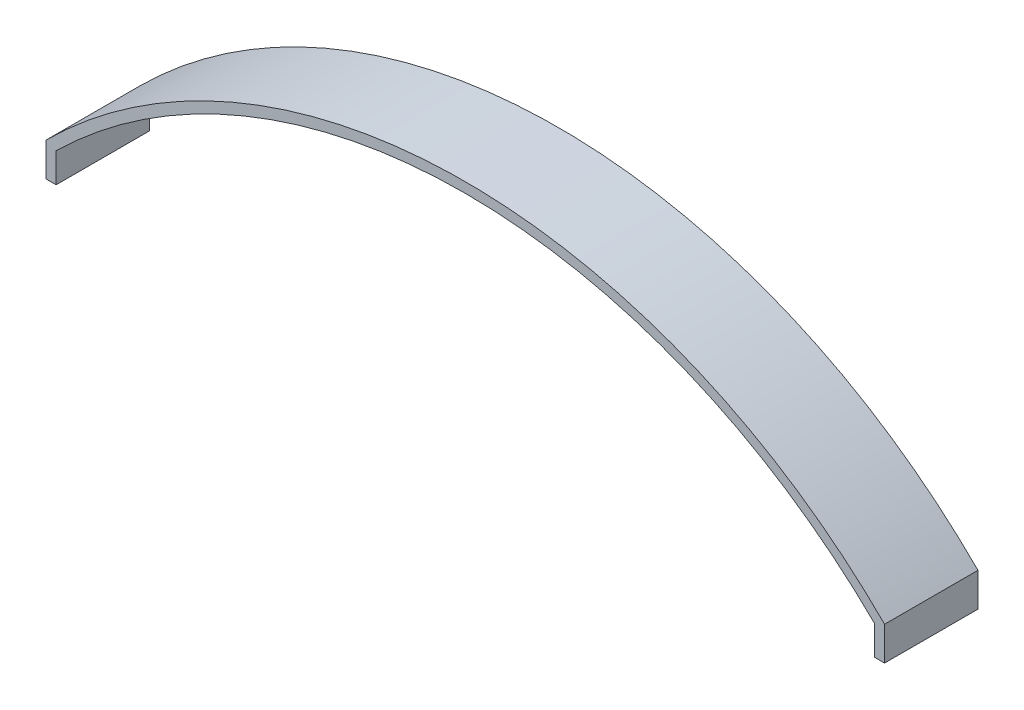
ISO-10303-21;
HEADER;
FILE_DESCRIPTION(('STEP AP214'),'2;1');
FILE_NAME('part.step','',(''),(''),'','','');
FILE_SCHEMA(('AUTOMOTIVE_DESIGN { 1 0 10303 214 1 1 1 1 }'));
ENDSEC;
DATA;
#1=APPLICATION_CONTEXT('core data for automotive mechanical design processes');
#2=APPLICATION_PROTOCOL_DEFINITION('international standard','automotive_design',2000,#1);
#3=PRODUCT_CONTEXT('',#1,'mechanical');
#4=PRODUCT('Part','Part','',(#3));
#5=PRODUCT_RELATED_PRODUCT_CATEGORY('part','',(#4));
#6=PRODUCT_DEFINITION_FORMATION('','',#4);
#7=PRODUCT_DEFINITION_CONTEXT('part definition',#1,'design');
#8=PRODUCT_DEFINITION('design','',#6,#7);
#9=PRODUCT_DEFINITION_SHAPE('','',#8);
#10=(LENGTH_UNIT() NAMED_UNIT(*) SI_UNIT(.MILLI.,.METRE.));
#11=(NAMED_UNIT(*) PLANE_ANGLE_UNIT() SI_UNIT($,.RADIAN.));
#12=(NAMED_UNIT(*) SI_UNIT($,.STERADIAN.) SOLID_ANGLE_UNIT());
#13=UNCERTAINTY_MEASURE_WITH_UNIT(LENGTH_MEASURE(1.E-05),#10,'distance_accuracy_value','');
#14=(GEOMETRIC_REPRESENTATION_CONTEXT(3) GLOBAL_UNCERTAINTY_ASSIGNED_CONTEXT((#13)) GLOBAL_UNIT_ASSIGNED_CONTEXT((#10,
#11,#12)) REPRESENTATION_CONTEXT('',''));
#15=CARTESIAN_POINT('',(0.,0.,0.));
#16=DIRECTION('',(0.,0.,1.));
#17=DIRECTION('',(1.,0.,0.));
#18=AXIS2_PLACEMENT_3D('',#15,#16,#17);
#19=CARTESIAN_POINT('',(0.,-167.386868351904,-40.56));
#20=DIRECTION('',(0.,0.,1.));
#21=DIRECTION('',(1.,0.,0.));
#22=AXIS2_PLACEMENT_3D('',#19,#20,#21);
#23=CYLINDRICAL_SURFACE('',#22,257.386868351904);
#24=CARTESIAN_POINT('',(0.,-167.386868351904,0.));
#25=DIRECTION('',(0.,0.,1.));
#26=DIRECTION('',(-1.,0.,0.));
#27=AXIS2_PLACEMENT_3D('',#24,#25,#26);
#28=CIRCLE('',#27,257.386868351904);
#29=CARTESIAN_POINT('',(182.,14.6131316480968,0.));
#30=VERTEX_POINT('',#29);
#31=CARTESIAN_POINT('',(-182.,14.6131316480968,0.));
#32=VERTEX_POINT('',#31);
#33=EDGE_CURVE('E145',#30,#32,#28,.T.);
#34=ORIENTED_EDGE('',*,*,#33,.F.);
#35=DIRECTION('',(0.,0.,1.));
#36=VECTOR('',#35,1.);
#37=CARTESIAN_POINT('',(182.,14.6131316480968,-40.56));
#38=LINE('',#37,#36);
#39=CARTESIAN_POINT('',(182.,14.6131316480968,-40.56));
#40=VERTEX_POINT('',#39);
#41=EDGE_CURVE('E11',#40,#30,#38,.T.);
#42=ORIENTED_EDGE('',*,*,#41,.F.);
#43=CARTESIAN_POINT('',(0.,-167.386868351904,-40.56));
#44=DIRECTION('',(0.,0.,1.));
#45=DIRECTION('',(-1.,0.,0.));
#46=AXIS2_PLACEMENT_3D('',#43,#44,#45);
#47=CIRCLE('',#46,257.386868351904);
#48=CARTESIAN_POINT('',(-182.,14.6131316480968,-40.56));
#49=VERTEX_POINT('',#48);
#50=EDGE_CURVE('E173',#40,#49,#47,.T.);
#51=ORIENTED_EDGE('',*,*,#50,.T.);
#52=DIRECTION('',(0.,0.,1.));
#53=VECTOR('',#52,1.);
#54=CARTESIAN_POINT('',(-182.,14.6131316480968,-40.56));
#55=LINE('',#54,#53);
#56=EDGE_CURVE('E48',#49,#32,#55,.T.);
#57=ORIENTED_EDGE('',*,*,#56,.T.);
#58=EDGE_LOOP('',(#34,#42,#51,#57));
#59=FACE_BOUND('',#58,.T.);
#60=ADVANCED_FACE('F45',(#59),#23,.T.);
#61=CARTESIAN_POINT('',(182.,14.6131316480968,-40.56));
#62=DIRECTION('',(1.,0.,0.));
#63=DIRECTION('',(0.,0.,-1.));
#64=AXIS2_PLACEMENT_3D('',#61,#62,#63);
#65=PLANE('',#64);
#66=DIRECTION('',(0.,1.,0.));
#67=VECTOR('',#66,1.);
#68=CARTESIAN_POINT('',(182.,14.6131316480968,0.));
#69=LINE('',#68,#67);
#70=CARTESIAN_POINT('',(182.,0.,0.));
#71=VERTEX_POINT('',#70);
#72=EDGE_CURVE('E170',#71,#30,#69,.T.);
#73=ORIENTED_EDGE('',*,*,#72,.F.);
#74=DIRECTION('',(0.,0.,1.));
#75=VECTOR('',#74,1.);
#76=CARTESIAN_POINT('',(182.,0.,-40.56));
#77=LINE('',#76,#75);
#78=CARTESIAN_POINT('',(182.,0.,-40.56));
#79=VERTEX_POINT('',#78);
#80=EDGE_CURVE('E55',#79,#71,#77,.T.);
#81=ORIENTED_EDGE('',*,*,#80,.F.);
#82=DIRECTION('',(0.,1.,0.));
#83=VECTOR('',#82,1.);
#84=CARTESIAN_POINT('',(182.,14.6131316480968,-40.56));
#85=LINE('',#84,#83);
#86=EDGE_CURVE('E138',#79,#40,#85,.T.);
#87=ORIENTED_EDGE('',*,*,#86,.T.);
#88=ORIENTED_EDGE('',*,*,#41,.T.);
#89=EDGE_LOOP('',(#73,#81,#87,#88));
#90=FACE_BOUND('',#89,.T.);
#91=ADVANCED_FACE('F192',(#90),#65,.T.);
#92=CARTESIAN_POINT('',(177.6,0.,-40.56));
#93=DIRECTION('',(0.,-1.,0.));
#94=DIRECTION('',(0.,0.,-1.));
#95=AXIS2_PLACEMENT_3D('',#92,#93,#94);
#96=PLANE('',#95);
#97=DIRECTION('',(1.,0.,0.));
#98=VECTOR('',#97,1.);
#99=CARTESIAN_POINT('',(177.6,0.,0.));
#100=LINE('',#99,#98);
#101=CARTESIAN_POINT('',(177.6,0.,0.));
#102=VERTEX_POINT('',#101);
#103=EDGE_CURVE('E133',#102,#71,#100,.T.);
#104=ORIENTED_EDGE('',*,*,#103,.F.);
#105=DIRECTION('',(0.,0.,1.));
#106=VECTOR('',#105,1.);
#107=CARTESIAN_POINT('',(177.6,0.,-40.56));
#108=LINE('',#107,#106);
#109=CARTESIAN_POINT('',(177.6,0.,-40.56));
#110=VERTEX_POINT('',#109);
#111=EDGE_CURVE('E120',#110,#102,#108,.T.);
#112=ORIENTED_EDGE('',*,*,#111,.F.);
#113=DIRECTION('',(1.,0.,0.));
#114=VECTOR('',#113,1.);
#115=CARTESIAN_POINT('',(177.6,0.,-40.56));
#116=LINE('',#115,#114);
#117=EDGE_CURVE('E128',#110,#79,#116,.T.);
#118=ORIENTED_EDGE('',*,*,#117,.T.);
#119=ORIENTED_EDGE('',*,*,#80,.T.);
#120=EDGE_LOOP('',(#104,#112,#118,#119));
#121=FACE_BOUND('',#120,.T.);
#122=ADVANCED_FACE('F131',(#121),#96,.T.);
#123=CARTESIAN_POINT('',(177.6,4.4,-40.56));
#124=DIRECTION('',(-1.,0.,0.));
#125=DIRECTION('',(0.,0.,1.));
#126=AXIS2_PLACEMENT_3D('',#123,#124,#125);
#127=PLANE('',#126);
#128=DIRECTION('',(0.,-1.,0.));
#129=VECTOR('',#128,1.);
#130=CARTESIAN_POINT('',(177.6,4.4,0.));
#131=LINE('',#130,#129);
#132=CARTESIAN_POINT('',(177.6,12.7813740175645,0.));
#133=VERTEX_POINT('',#132);
#134=EDGE_CURVE('E165',#133,#102,#131,.T.);
#135=ORIENTED_EDGE('',*,*,#134,.F.);
#136=DIRECTION('',(0.,0.,1.));
#137=VECTOR('',#136,1.);
#138=CARTESIAN_POINT('',(177.6,12.7813740175645,-40.56));
#139=LINE('',#138,#137);
#140=CARTESIAN_POINT('',(177.6,12.7813740175645,-40.56));
#141=VERTEX_POINT('',#140);
#142=EDGE_CURVE('E122',#141,#133,#139,.T.);
#143=ORIENTED_EDGE('',*,*,#142,.F.);
#144=DIRECTION('',(0.,-1.,0.));
#145=VECTOR('',#144,1.);
#146=CARTESIAN_POINT('',(177.6,12.7813740175645,-40.56));
#147=LINE('',#146,#145);
#148=EDGE_CURVE('E117',#141,#110,#147,.T.);
#149=ORIENTED_EDGE('',*,*,#148,.T.);
#150=ORIENTED_EDGE('',*,*,#111,.T.);
#151=EDGE_LOOP('',(#135,#143,#149,#150));
#152=FACE_BOUND('',#151,.T.);
#153=ADVANCED_FACE('F119',(#152),#127,.T.);
#154=CARTESIAN_POINT('',(0.,-167.386868351904,-40.56));
#155=DIRECTION('',(0.,0.,1.));
#156=DIRECTION('',(1.,0.,0.));
#157=AXIS2_PLACEMENT_3D('',#154,#155,#156);
#158=CYLINDRICAL_SURFACE('',#157,252.986868351904);
#159=CARTESIAN_POINT('',(0.,-167.386868351904,0.));
#160=DIRECTION('',(0.,0.,-1.));
#161=DIRECTION('',(-1.,0.,0.));
#162=AXIS2_PLACEMENT_3D('',#159,#160,#161);
#163=CIRCLE('',#162,252.986868351904);
#164=CARTESIAN_POINT('',(-177.6,12.7813740175644,0.));
#165=VERTEX_POINT('',#164);
#166=EDGE_CURVE('E161',#165,#133,#163,.T.);
#167=ORIENTED_EDGE('',*,*,#166,.F.);
#168=DIRECTION('',(0.,0.,1.));
#169=VECTOR('',#168,1.);
#170=CARTESIAN_POINT('',(-177.6,12.7813740175644,-40.56));
#171=LINE('',#170,#169);
#172=CARTESIAN_POINT('',(-177.6,12.7813740175644,-40.56));
#173=VERTEX_POINT('',#172);
#174=EDGE_CURVE('E179',#173,#165,#171,.T.);
#175=ORIENTED_EDGE('',*,*,#174,.F.);
#176=CARTESIAN_POINT('',(0.,-167.386868351904,-40.56));
#177=DIRECTION('',(0.,0.,-1.));
#178=DIRECTION('',(-1.,0.,0.));
#179=AXIS2_PLACEMENT_3D('',#176,#177,#178);
#180=CIRCLE('',#179,252.986868351904);
#181=EDGE_CURVE('E129',#173,#141,#180,.T.);
#182=ORIENTED_EDGE('',*,*,#181,.T.);
#183=ORIENTED_EDGE('',*,*,#142,.T.);
#184=EDGE_LOOP('',(#167,#175,#182,#183));
#185=FACE_BOUND('',#184,.T.);
#186=ADVANCED_FACE('F205',(#185),#158,.F.);
#187=CARTESIAN_POINT('',(-177.6,12.7813740175644,-40.56));
#188=DIRECTION('',(1.,0.,0.));
#189=DIRECTION('',(0.,0.,-1.));
#190=AXIS2_PLACEMENT_3D('',#187,#188,#189);
#191=PLANE('',#190);
#192=DIRECTION('',(0.,1.,0.));
#193=VECTOR('',#192,1.);
#194=CARTESIAN_POINT('',(-177.6,12.7813740175644,0.));
#195=LINE('',#194,#193);
#196=CARTESIAN_POINT('',(-177.6,0.,0.));
#197=VERTEX_POINT('',#196);
#198=EDGE_CURVE('E157',#197,#165,#195,.T.);
#199=ORIENTED_EDGE('',*,*,#198,.F.);
#200=DIRECTION('',(0.,0.,1.));
#201=VECTOR('',#200,1.);
#202=CARTESIAN_POINT('',(-177.6,0.,-40.56));
#203=LINE('',#202,#201);
#204=CARTESIAN_POINT('',(-177.6,0.,-40.56));
#205=VERTEX_POINT('',#204);
#206=EDGE_CURVE('E182',#205,#197,#203,.T.);
#207=ORIENTED_EDGE('',*,*,#206,.F.);
#208=DIRECTION('',(0.,1.,0.));
#209=VECTOR('',#208,1.);
#210=CARTESIAN_POINT('',(-177.6,4.4,-40.56));
#211=LINE('',#210,#209);
#212=EDGE_CURVE('E288',#205,#173,#211,.T.);
#213=ORIENTED_EDGE('',*,*,#212,.T.);
#214=ORIENTED_EDGE('',*,*,#174,.T.);
#215=EDGE_LOOP('',(#199,#207,#213,#214));
#216=FACE_BOUND('',#215,.T.);
#217=ADVANCED_FACE('F208',(#216),#191,.T.);
#218=CARTESIAN_POINT('',(-177.6,0.,-40.56));
#219=DIRECTION('',(0.,-1.,0.));
#220=DIRECTION('',(0.,0.,-1.));
#221=AXIS2_PLACEMENT_3D('',#218,#219,#220);
#222=PLANE('',#221);
#223=DIRECTION('',(1.,0.,0.));
#224=VECTOR('',#223,1.);
#225=CARTESIAN_POINT('',(-177.6,0.,0.));
#226=LINE('',#225,#224);
#227=CARTESIAN_POINT('',(-182.,0.,0.));
#228=VERTEX_POINT('',#227);
#229=EDGE_CURVE('E153',#228,#197,#226,.T.);
#230=ORIENTED_EDGE('',*,*,#229,.F.);
#231=DIRECTION('',(0.,0.,1.));
#232=VECTOR('',#231,1.);
#233=CARTESIAN_POINT('',(-182.,0.,-40.56));
#234=LINE('',#233,#232);
#235=CARTESIAN_POINT('',(-182.,0.,-40.56));
#236=VERTEX_POINT('',#235);
#237=EDGE_CURVE('E185',#236,#228,#234,.T.);
#238=ORIENTED_EDGE('',*,*,#237,.F.);
#239=DIRECTION('',(1.,0.,0.));
#240=VECTOR('',#239,1.);
#241=CARTESIAN_POINT('',(-177.6,0.,-40.56));
#242=LINE('',#241,#240);
#243=EDGE_CURVE('E291',#236,#205,#242,.T.);
#244=ORIENTED_EDGE('',*,*,#243,.T.);
#245=ORIENTED_EDGE('',*,*,#206,.T.);
#246=EDGE_LOOP('',(#230,#238,#244,#245));
#247=FACE_BOUND('',#246,.T.);
#248=ADVANCED_FACE('F212',(#247),#222,.T.);
#249=CARTESIAN_POINT('',(-182.,14.6131316480968,-40.56));
#250=DIRECTION('',(-1.,0.,0.));
#251=DIRECTION('',(0.,0.,1.));
#252=AXIS2_PLACEMENT_3D('',#249,#250,#251);
#253=PLANE('',#252);
#254=DIRECTION('',(0.,-1.,0.));
#255=VECTOR('',#254,1.);
#256=CARTESIAN_POINT('',(-182.,14.6131316480968,0.));
#257=LINE('',#256,#255);
#258=EDGE_CURVE('E149',#32,#228,#257,.T.);
#259=ORIENTED_EDGE('',*,*,#258,.F.);
#260=ORIENTED_EDGE('',*,*,#56,.F.);
#261=DIRECTION('',(0.,-1.,0.));
#262=VECTOR('',#261,1.);
#263=CARTESIAN_POINT('',(-182.,14.6131316480968,-40.56));
#264=LINE('',#263,#262);
#265=EDGE_CURVE('E296',#49,#236,#264,.T.);
#266=ORIENTED_EDGE('',*,*,#265,.T.);
#267=ORIENTED_EDGE('',*,*,#237,.T.);
#268=EDGE_LOOP('',(#259,#260,#266,#267));
#269=FACE_BOUND('',#268,.T.);
#270=ADVANCED_FACE('F189',(#269),#253,.T.);
#271=CARTESIAN_POINT('',(0.,-167.386868351904,-40.56));
#272=DIRECTION('',(0.,0.,-1.));
#273=DIRECTION('',(-1.,0.,0.));
#274=AXIS2_PLACEMENT_3D('',#271,#272,#273);
#275=PLANE('',#274);
#276=ORIENTED_EDGE('',*,*,#50,.F.);
#277=ORIENTED_EDGE('',*,*,#86,.F.);
#278=ORIENTED_EDGE('',*,*,#117,.F.);
#279=ORIENTED_EDGE('',*,*,#148,.F.);
#280=ORIENTED_EDGE('',*,*,#181,.F.);
#281=ORIENTED_EDGE('',*,*,#212,.F.);
#282=ORIENTED_EDGE('',*,*,#243,.F.);
#283=ORIENTED_EDGE('',*,*,#265,.F.);
#284=EDGE_LOOP('',(#276,#277,#278,#279,#280,#281,#282,#283));
#285=FACE_BOUND('',#284,.T.);
#286=ADVANCED_FACE('F137',(#285),#275,.T.);
#287=CARTESIAN_POINT('',(0.,-167.386868351904,0.));
#288=DIRECTION('',(0.,0.,-1.));
#289=DIRECTION('',(-1.,0.,0.));
#290=AXIS2_PLACEMENT_3D('',#287,#288,#289);
#291=PLANE('',#290);
#292=ORIENTED_EDGE('',*,*,#33,.T.);
#293=ORIENTED_EDGE('',*,*,#258,.T.);
#294=ORIENTED_EDGE('',*,*,#229,.T.);
#295=ORIENTED_EDGE('',*,*,#198,.T.);
#296=ORIENTED_EDGE('',*,*,#166,.T.);
#297=ORIENTED_EDGE('',*,*,#134,.T.);
#298=ORIENTED_EDGE('',*,*,#103,.T.);
#299=ORIENTED_EDGE('',*,*,#72,.T.);
#300=EDGE_LOOP('',(#292,#293,#294,#295,#296,#297,#298,#299));
#301=FACE_BOUND('',#300,.T.);
#302=ADVANCED_FACE('F191',(#301),#291,.F.);
#303=CLOSED_SHELL('',(#60,#91,#122,#153,#186,#217,#248,#270,#286,#302));
#304=MANIFOLD_SOLID_BREP('B2',#303);
#305=ADVANCED_BREP_SHAPE_REPRESENTATION('',(#18,#304),#14);
#306=SHAPE_DEFINITION_REPRESENTATION(#9,#305);
ENDSEC;
END-ISO-10303-21;
